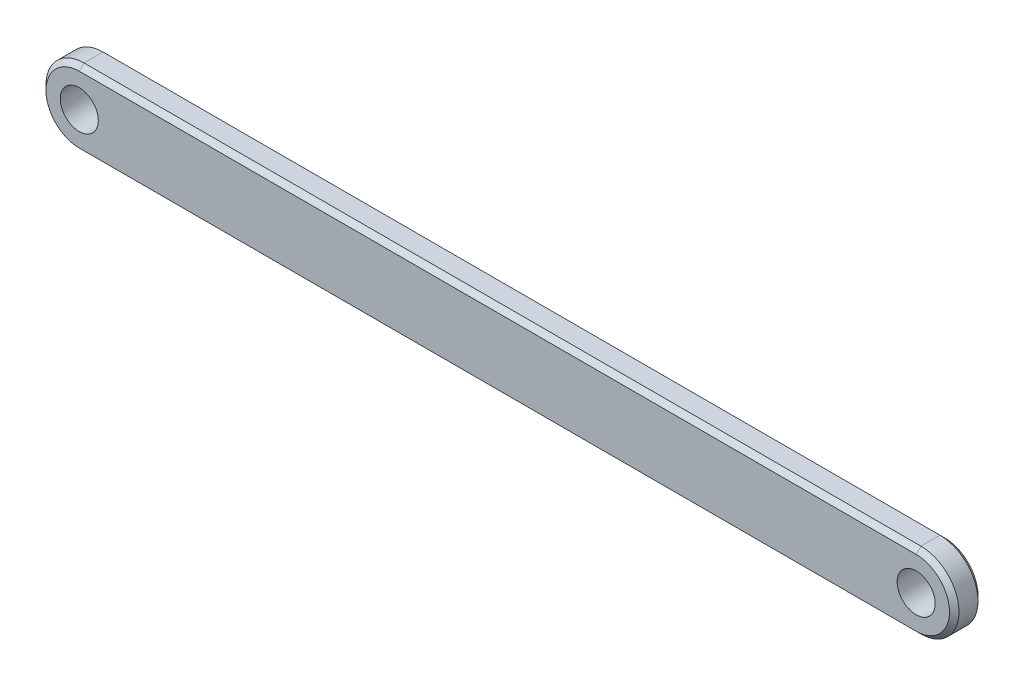
ISO-10303-21;
HEADER;
FILE_DESCRIPTION(('STEP AP214'),'2;1');
FILE_NAME('part.step','',(''),(''),'','','');
FILE_SCHEMA(('AUTOMOTIVE_DESIGN { 1 0 10303 214 1 1 1 1 }'));
ENDSEC;
DATA;
#1=APPLICATION_CONTEXT('core data for automotive mechanical design processes');
#2=APPLICATION_PROTOCOL_DEFINITION('international standard','automotive_design',2000,#1);
#3=PRODUCT_CONTEXT('',#1,'mechanical');
#4=PRODUCT('Part','Part','',(#3));
#5=PRODUCT_RELATED_PRODUCT_CATEGORY('part','',(#4));
#6=PRODUCT_DEFINITION_FORMATION('','',#4);
#7=PRODUCT_DEFINITION_CONTEXT('part definition',#1,'design');
#8=PRODUCT_DEFINITION('design','',#6,#7);
#9=PRODUCT_DEFINITION_SHAPE('','',#8);
#10=(LENGTH_UNIT() NAMED_UNIT(*) SI_UNIT(.MILLI.,.METRE.));
#11=(NAMED_UNIT(*) PLANE_ANGLE_UNIT() SI_UNIT($,.RADIAN.));
#12=(NAMED_UNIT(*) SI_UNIT($,.STERADIAN.) SOLID_ANGLE_UNIT());
#13=UNCERTAINTY_MEASURE_WITH_UNIT(LENGTH_MEASURE(1.E-05),#10,'distance_accuracy_value','');
#14=(GEOMETRIC_REPRESENTATION_CONTEXT(3) GLOBAL_UNCERTAINTY_ASSIGNED_CONTEXT((#13)) GLOBAL_UNIT_ASSIGNED_CONTEXT((#10,
#11,#12)) REPRESENTATION_CONTEXT('',''));
#15=CARTESIAN_POINT('',(0.,0.,0.));
#16=DIRECTION('',(0.,0.,1.));
#17=DIRECTION('',(1.,0.,0.));
#18=AXIS2_PLACEMENT_3D('',#15,#16,#17);
#19=CARTESIAN_POINT('',(-44.,0.,1.5));
#20=DIRECTION('',(0.,0.,1.));
#21=DIRECTION('',(1.,0.,0.));
#22=AXIS2_PLACEMENT_3D('',#19,#20,#21);
#23=PLANE('',#22);
#24=DIRECTION('',(1.,0.,0.));
#25=VECTOR('',#24,1.);
#26=CARTESIAN_POINT('',(44.,-3.49999999999998,1.5));
#27=LINE('',#26,#25);
#28=CARTESIAN_POINT('',(-44.,-3.5,1.5));
#29=VERTEX_POINT('',#28);
#30=CARTESIAN_POINT('',(44.,-3.49999999999998,1.5));
#31=VERTEX_POINT('',#30);
#32=EDGE_CURVE('E58',#29,#31,#27,.T.);
#33=ORIENTED_EDGE('',*,*,#32,.T.);
#34=CARTESIAN_POINT('',(44.,0.,1.5));
#35=DIRECTION('',(0.,0.,1.));
#36=DIRECTION('',(1.,0.,0.));
#37=AXIS2_PLACEMENT_3D('',#34,#35,#36);
#38=CIRCLE('',#37,3.5);
#39=CARTESIAN_POINT('',(44.,3.50000000000002,1.5));
#40=VERTEX_POINT('',#39);
#41=EDGE_CURVE('E11',#31,#40,#38,.T.);
#42=ORIENTED_EDGE('',*,*,#41,.T.);
#43=DIRECTION('',(-1.,0.,0.));
#44=VECTOR('',#43,1.);
#45=CARTESIAN_POINT('',(-44.,3.5,1.5));
#46=LINE('',#45,#44);
#47=CARTESIAN_POINT('',(-44.,3.5,1.5));
#48=VERTEX_POINT('',#47);
#49=EDGE_CURVE('E43',#40,#48,#46,.T.);
#50=ORIENTED_EDGE('',*,*,#49,.T.);
#51=CARTESIAN_POINT('',(-44.,0.,1.5));
#52=DIRECTION('',(0.,0.,1.));
#53=DIRECTION('',(1.,0.,0.));
#54=AXIS2_PLACEMENT_3D('',#51,#52,#53);
#55=CIRCLE('',#54,3.5);
#56=EDGE_CURVE('E198',#48,#29,#55,.T.);
#57=ORIENTED_EDGE('',*,*,#56,.T.);
#58=EDGE_LOOP('',(#33,#42,#50,#57));
#59=FACE_BOUND('',#58,.T.);
#60=CARTESIAN_POINT('',(-44.,0.,1.5));
#61=DIRECTION('',(0.,0.,1.));
#62=DIRECTION('',(1.,0.,0.));
#63=AXIS2_PLACEMENT_3D('',#60,#61,#62);
#64=CIRCLE('',#63,2.);
#65=CARTESIAN_POINT('',(-42.,0.,1.5));
#66=VERTEX_POINT('',#65);
#67=EDGE_CURVE('E171',#66,#66,#64,.T.);
#68=ORIENTED_EDGE('',*,*,#67,.F.);
#69=EDGE_LOOP('',(#68));
#70=FACE_BOUND('',#69,.T.);
#71=CARTESIAN_POINT('',(44.,0.,1.5));
#72=DIRECTION('',(0.,0.,1.));
#73=DIRECTION('',(1.,0.,0.));
#74=AXIS2_PLACEMENT_3D('',#71,#72,#73);
#75=CIRCLE('',#74,2.);
#76=CARTESIAN_POINT('',(46.,0.,1.5));
#77=VERTEX_POINT('',#76);
#78=EDGE_CURVE('E163',#77,#77,#75,.T.);
#79=ORIENTED_EDGE('',*,*,#78,.F.);
#80=EDGE_LOOP('',(#79));
#81=FACE_BOUND('',#80,.T.);
#82=ADVANCED_FACE('F34',(#59,#70,#81),#23,.T.);
#83=CARTESIAN_POINT('',(-44.,0.,-1.5));
#84=DIRECTION('',(0.,0.,1.));
#85=DIRECTION('',(1.,0.,0.));
#86=AXIS2_PLACEMENT_3D('',#83,#84,#85);
#87=PLANE('',#86);
#88=DIRECTION('',(1.,0.,0.));
#89=VECTOR('',#88,1.);
#90=CARTESIAN_POINT('',(-44.,3.5,-1.5));
#91=LINE('',#90,#89);
#92=CARTESIAN_POINT('',(-44.,3.5,-1.5));
#93=VERTEX_POINT('',#92);
#94=CARTESIAN_POINT('',(44.,3.50000000000002,-1.5));
#95=VERTEX_POINT('',#94);
#96=EDGE_CURVE('E185',#93,#95,#91,.T.);
#97=ORIENTED_EDGE('',*,*,#96,.T.);
#98=CARTESIAN_POINT('',(44.,0.,-1.5));
#99=DIRECTION('',(0.,0.,1.));
#100=DIRECTION('',(1.,0.,0.));
#101=AXIS2_PLACEMENT_3D('',#98,#99,#100);
#102=CIRCLE('',#101,3.5);
#103=CARTESIAN_POINT('',(44.,-3.49999999999998,-1.5));
#104=VERTEX_POINT('',#103);
#105=EDGE_CURVE('E114',#95,#104,#102,.F.);
#106=ORIENTED_EDGE('',*,*,#105,.T.);
#107=DIRECTION('',(-1.,0.,0.));
#108=VECTOR('',#107,1.);
#109=CARTESIAN_POINT('',(-44.,-3.5,-1.5));
#110=LINE('',#109,#108);
#111=CARTESIAN_POINT('',(-44.,-3.5,-1.5));
#112=VERTEX_POINT('',#111);
#113=EDGE_CURVE('E183',#104,#112,#110,.T.);
#114=ORIENTED_EDGE('',*,*,#113,.T.);
#115=CARTESIAN_POINT('',(-44.,0.,-1.5));
#116=DIRECTION('',(0.,0.,1.));
#117=DIRECTION('',(1.,0.,0.));
#118=AXIS2_PLACEMENT_3D('',#115,#116,#117);
#119=CIRCLE('',#118,3.5);
#120=EDGE_CURVE('E181',#112,#93,#119,.F.);
#121=ORIENTED_EDGE('',*,*,#120,.T.);
#122=EDGE_LOOP('',(#97,#106,#114,#121));
#123=FACE_BOUND('',#122,.T.);
#124=CARTESIAN_POINT('',(-44.,0.,-1.5));
#125=DIRECTION('',(0.,0.,1.));
#126=DIRECTION('',(1.,0.,0.));
#127=AXIS2_PLACEMENT_3D('',#124,#125,#126);
#128=CIRCLE('',#127,2.);
#129=CARTESIAN_POINT('',(-42.,0.,-1.5));
#130=VERTEX_POINT('',#129);
#131=EDGE_CURVE('E168',#130,#130,#128,.T.);
#132=ORIENTED_EDGE('',*,*,#131,.T.);
#133=EDGE_LOOP('',(#132));
#134=FACE_BOUND('',#133,.T.);
#135=CARTESIAN_POINT('',(44.,0.,-1.5));
#136=DIRECTION('',(0.,0.,1.));
#137=DIRECTION('',(1.,0.,0.));
#138=AXIS2_PLACEMENT_3D('',#135,#136,#137);
#139=CIRCLE('',#138,2.);
#140=CARTESIAN_POINT('',(46.,0.,-1.5));
#141=VERTEX_POINT('',#140);
#142=EDGE_CURVE('E157',#141,#141,#139,.T.);
#143=ORIENTED_EDGE('',*,*,#142,.T.);
#144=EDGE_LOOP('',(#143));
#145=FACE_BOUND('',#144,.T.);
#146=ADVANCED_FACE('F227',(#123,#134,#145),#87,.F.);
#147=CARTESIAN_POINT('',(-44.,0.,1.5));
#148=DIRECTION('',(0.,0.,-1.));
#149=DIRECTION('',(-1.,0.,0.));
#150=AXIS2_PLACEMENT_3D('',#147,#148,#149);
#151=CYLINDRICAL_SURFACE('',#150,4.);
#152=DIRECTION('',(0.,0.,-1.));
#153=VECTOR('',#152,1.);
#154=CARTESIAN_POINT('',(-44.,4.,1.5));
#155=LINE('',#154,#153);
#156=CARTESIAN_POINT('',(-44.,4.,1.));
#157=VERTEX_POINT('',#156);
#158=CARTESIAN_POINT('',(-44.,4.,-1.00000000000002));
#159=VERTEX_POINT('',#158);
#160=EDGE_CURVE('E109',#157,#159,#155,.T.);
#161=ORIENTED_EDGE('',*,*,#160,.T.);
#162=CARTESIAN_POINT('',(-44.,0.,-1.00000000000002));
#163=DIRECTION('',(0.,0.,1.));
#164=DIRECTION('',(1.,0.,0.));
#165=AXIS2_PLACEMENT_3D('',#162,#163,#164);
#166=CIRCLE('',#165,4.);
#167=CARTESIAN_POINT('',(-44.,-4.,-1.00000000000002));
#168=VERTEX_POINT('',#167);
#169=EDGE_CURVE('E196',#159,#168,#166,.T.);
#170=ORIENTED_EDGE('',*,*,#169,.T.);
#171=DIRECTION('',(0.,0.,-1.));
#172=VECTOR('',#171,1.);
#173=CARTESIAN_POINT('',(-44.,-4.,1.5));
#174=LINE('',#173,#172);
#175=CARTESIAN_POINT('',(-44.,-4.,1.));
#176=VERTEX_POINT('',#175);
#177=EDGE_CURVE('E130',#176,#168,#174,.T.);
#178=ORIENTED_EDGE('',*,*,#177,.F.);
#179=CARTESIAN_POINT('',(-44.,0.,1.));
#180=DIRECTION('',(0.,0.,1.));
#181=DIRECTION('',(1.,0.,0.));
#182=AXIS2_PLACEMENT_3D('',#179,#180,#181);
#183=CIRCLE('',#182,4.);
#184=EDGE_CURVE('E194',#176,#157,#183,.F.);
#185=ORIENTED_EDGE('',*,*,#184,.T.);
#186=EDGE_LOOP('',(#161,#170,#178,#185));
#187=FACE_BOUND('',#186,.T.);
#188=ADVANCED_FACE('F209',(#187),#151,.T.);
#189=CARTESIAN_POINT('',(-44.,-4.,1.5));
#190=DIRECTION('',(0.,1.,0.));
#191=DIRECTION('',(-1.,0.,0.));
#192=AXIS2_PLACEMENT_3D('',#189,#190,#191);
#193=PLANE('',#192);
#194=ORIENTED_EDGE('',*,*,#177,.T.);
#195=DIRECTION('',(1.,0.,0.));
#196=VECTOR('',#195,1.);
#197=CARTESIAN_POINT('',(-44.,-4.,-1.00000000000002));
#198=LINE('',#197,#196);
#199=CARTESIAN_POINT('',(44.,-3.99999999999998,-1.00000000000002));
#200=VERTEX_POINT('',#199);
#201=EDGE_CURVE('E192',#168,#200,#198,.T.);
#202=ORIENTED_EDGE('',*,*,#201,.T.);
#203=DIRECTION('',(0.,0.,-1.));
#204=VECTOR('',#203,1.);
#205=CARTESIAN_POINT('',(44.,-3.99999999999998,1.5));
#206=LINE('',#205,#204);
#207=CARTESIAN_POINT('',(44.,-3.99999999999998,1.));
#208=VERTEX_POINT('',#207);
#209=EDGE_CURVE('E125',#208,#200,#206,.T.);
#210=ORIENTED_EDGE('',*,*,#209,.F.);
#211=DIRECTION('',(-1.,0.,0.));
#212=VECTOR('',#211,1.);
#213=CARTESIAN_POINT('',(-44.,-4.,1.));
#214=LINE('',#213,#212);
#215=EDGE_CURVE('E190',#208,#176,#214,.T.);
#216=ORIENTED_EDGE('',*,*,#215,.T.);
#217=EDGE_LOOP('',(#194,#202,#210,#216));
#218=FACE_BOUND('',#217,.T.);
#219=ADVANCED_FACE('F207',(#218),#193,.F.);
#220=CARTESIAN_POINT('',(44.,0.,1.5));
#221=DIRECTION('',(0.,0.,-1.));
#222=DIRECTION('',(-1.,0.,0.));
#223=AXIS2_PLACEMENT_3D('',#220,#221,#222);
#224=CYLINDRICAL_SURFACE('',#223,4.);
#225=ORIENTED_EDGE('',*,*,#209,.T.);
#226=CARTESIAN_POINT('',(44.,0.,-1.00000000000002));
#227=DIRECTION('',(0.,0.,1.));
#228=DIRECTION('',(1.,0.,0.));
#229=AXIS2_PLACEMENT_3D('',#226,#227,#228);
#230=CIRCLE('',#229,4.);
#231=CARTESIAN_POINT('',(44.,4.00000000000002,-1.00000000000002));
#232=VERTEX_POINT('',#231);
#233=EDGE_CURVE('E124',#200,#232,#230,.T.);
#234=ORIENTED_EDGE('',*,*,#233,.T.);
#235=DIRECTION('',(0.,0.,-1.));
#236=VECTOR('',#235,1.);
#237=CARTESIAN_POINT('',(44.,4.00000000000002,1.5));
#238=LINE('',#237,#236);
#239=CARTESIAN_POINT('',(44.,4.00000000000002,1.));
#240=VERTEX_POINT('',#239);
#241=EDGE_CURVE('E107',#240,#232,#238,.T.);
#242=ORIENTED_EDGE('',*,*,#241,.F.);
#243=CARTESIAN_POINT('',(44.,0.,1.));
#244=DIRECTION('',(0.,0.,1.));
#245=DIRECTION('',(1.,0.,0.));
#246=AXIS2_PLACEMENT_3D('',#243,#244,#245);
#247=CIRCLE('',#246,4.);
#248=EDGE_CURVE('E121',#240,#208,#247,.F.);
#249=ORIENTED_EDGE('',*,*,#248,.T.);
#250=EDGE_LOOP('',(#225,#234,#242,#249));
#251=FACE_BOUND('',#250,.T.);
#252=ADVANCED_FACE('F120',(#251),#224,.T.);
#253=CARTESIAN_POINT('',(-44.,4.,1.5));
#254=DIRECTION('',(0.,-1.,0.));
#255=DIRECTION('',(1.,0.,0.));
#256=AXIS2_PLACEMENT_3D('',#253,#254,#255);
#257=PLANE('',#256);
#258=ORIENTED_EDGE('',*,*,#241,.T.);
#259=DIRECTION('',(-1.,0.,0.));
#260=VECTOR('',#259,1.);
#261=CARTESIAN_POINT('',(-44.,4.,-1.00000000000002));
#262=LINE('',#261,#260);
#263=EDGE_CURVE('E113',#232,#159,#262,.T.);
#264=ORIENTED_EDGE('',*,*,#263,.T.);
#265=ORIENTED_EDGE('',*,*,#160,.F.);
#266=DIRECTION('',(1.,0.,0.));
#267=VECTOR('',#266,1.);
#268=CARTESIAN_POINT('',(44.,4.00000000000002,1.));
#269=LINE('',#268,#267);
#270=EDGE_CURVE('E104',#157,#240,#269,.T.);
#271=ORIENTED_EDGE('',*,*,#270,.T.);
#272=EDGE_LOOP('',(#258,#264,#265,#271));
#273=FACE_BOUND('',#272,.T.);
#274=ADVANCED_FACE('F106',(#273),#257,.F.);
#275=CARTESIAN_POINT('',(-44.,0.,1.5));
#276=DIRECTION('',(0.,0.,-1.));
#277=DIRECTION('',(-1.,0.,0.));
#278=AXIS2_PLACEMENT_3D('',#275,#276,#277);
#279=CYLINDRICAL_SURFACE('',#278,2.);
#280=ORIENTED_EDGE('',*,*,#67,.T.);
#281=EDGE_LOOP('',(#280));
#282=FACE_BOUND('',#281,.T.);
#283=ORIENTED_EDGE('',*,*,#131,.F.);
#284=EDGE_LOOP('',(#283));
#285=FACE_BOUND('',#284,.T.);
#286=ADVANCED_FACE('F235',(#282,#285),#279,.F.);
#287=CARTESIAN_POINT('',(44.,0.,1.5));
#288=DIRECTION('',(0.,0.,-1.));
#289=DIRECTION('',(-1.,0.,0.));
#290=AXIS2_PLACEMENT_3D('',#287,#288,#289);
#291=CYLINDRICAL_SURFACE('',#290,2.);
#292=ORIENTED_EDGE('',*,*,#78,.T.);
#293=EDGE_LOOP('',(#292));
#294=FACE_BOUND('',#293,.T.);
#295=ORIENTED_EDGE('',*,*,#142,.F.);
#296=EDGE_LOOP('',(#295));
#297=FACE_BOUND('',#296,.T.);
#298=ADVANCED_FACE('F267',(#294,#297),#291,.F.);
#299=CARTESIAN_POINT('',(-44.,0.,-1.00000000000002));
#300=DIRECTION('',(0.,0.,1.));
#301=DIRECTION('',(1.,0.,0.));
#302=AXIS2_PLACEMENT_3D('',#299,#300,#301);
#303=CONICAL_SURFACE('',#302,4.,0.785398163397466);
#304=DIRECTION('',(0.,0.70710678118656,0.707106781186535));
#305=VECTOR('',#304,1.);
#306=CARTESIAN_POINT('',(-44.,3.5,-1.5));
#307=LINE('',#306,#305);
#308=EDGE_CURVE('E149',#93,#159,#307,.T.);
#309=ORIENTED_EDGE('',*,*,#308,.F.);
#310=ORIENTED_EDGE('',*,*,#120,.F.);
#311=DIRECTION('',(0.,0.70710678118656,-0.707106781186535));
#312=VECTOR('',#311,1.);
#313=CARTESIAN_POINT('',(-44.,-4.,-1.00000000000002));
#314=LINE('',#313,#312);
#315=EDGE_CURVE('E137',#168,#112,#314,.T.);
#316=ORIENTED_EDGE('',*,*,#315,.F.);
#317=ORIENTED_EDGE('',*,*,#169,.F.);
#318=EDGE_LOOP('',(#309,#310,#316,#317));
#319=FACE_BOUND('',#318,.T.);
#320=ADVANCED_FACE('F212',(#319),#303,.T.);
#321=CARTESIAN_POINT('',(-44.,-4.,-1.00000000000002));
#322=DIRECTION('',(0.,0.707106781186535,0.70710678118656));
#323=DIRECTION('',(1.,0.,0.));
#324=AXIS2_PLACEMENT_3D('',#321,#322,#323);
#325=PLANE('',#324);
#326=ORIENTED_EDGE('',*,*,#315,.T.);
#327=ORIENTED_EDGE('',*,*,#113,.F.);
#328=DIRECTION('',(0.,0.70710678118656,-0.707106781186535));
#329=VECTOR('',#328,1.);
#330=CARTESIAN_POINT('',(44.,-3.99999999999998,-1.00000000000002));
#331=LINE('',#330,#329);
#332=EDGE_CURVE('E143',#200,#104,#331,.T.);
#333=ORIENTED_EDGE('',*,*,#332,.F.);
#334=ORIENTED_EDGE('',*,*,#201,.F.);
#335=EDGE_LOOP('',(#326,#327,#333,#334));
#336=FACE_BOUND('',#335,.T.);
#337=ADVANCED_FACE('F215',(#336),#325,.F.);
#338=CARTESIAN_POINT('',(-44.,4.,-1.00000000000002));
#339=DIRECTION('',(0.,-0.707106781186535,0.70710678118656));
#340=DIRECTION('',(-1.,0.,0.));
#341=AXIS2_PLACEMENT_3D('',#338,#339,#340);
#342=PLANE('',#341);
#343=ORIENTED_EDGE('',*,*,#308,.T.);
#344=ORIENTED_EDGE('',*,*,#263,.F.);
#345=DIRECTION('',(0.,0.70710678118656,0.707106781186535));
#346=VECTOR('',#345,1.);
#347=CARTESIAN_POINT('',(44.,3.50000000000002,-1.5));
#348=LINE('',#347,#346);
#349=EDGE_CURVE('E140',#95,#232,#348,.T.);
#350=ORIENTED_EDGE('',*,*,#349,.F.);
#351=ORIENTED_EDGE('',*,*,#96,.F.);
#352=EDGE_LOOP('',(#343,#344,#350,#351));
#353=FACE_BOUND('',#352,.T.);
#354=ADVANCED_FACE('F218',(#353),#342,.F.);
#355=CARTESIAN_POINT('',(44.,0.,-1.00000000000002));
#356=DIRECTION('',(0.,0.,1.));
#357=DIRECTION('',(1.,0.,0.));
#358=AXIS2_PLACEMENT_3D('',#355,#356,#357);
#359=CONICAL_SURFACE('',#358,4.,0.785398163397466);
#360=ORIENTED_EDGE('',*,*,#332,.T.);
#361=ORIENTED_EDGE('',*,*,#105,.F.);
#362=ORIENTED_EDGE('',*,*,#349,.T.);
#363=ORIENTED_EDGE('',*,*,#233,.F.);
#364=EDGE_LOOP('',(#360,#361,#362,#363));
#365=FACE_BOUND('',#364,.T.);
#366=ADVANCED_FACE('F216',(#365),#359,.T.);
#367=CARTESIAN_POINT('',(-44.,0.,1.5));
#368=DIRECTION('',(0.,0.,-1.));
#369=DIRECTION('',(-1.,0.,0.));
#370=AXIS2_PLACEMENT_3D('',#367,#368,#369);
#371=CONICAL_SURFACE('',#370,3.5,0.785398163397452);
#372=DIRECTION('',(0.,-0.70710678118655,0.707106781186545));
#373=VECTOR('',#372,1.);
#374=CARTESIAN_POINT('',(-44.,4.,1.));
#375=LINE('',#374,#373);
#376=EDGE_CURVE('E134',#157,#48,#375,.T.);
#377=ORIENTED_EDGE('',*,*,#376,.F.);
#378=ORIENTED_EDGE('',*,*,#184,.F.);
#379=DIRECTION('',(0.,-0.70710678118655,-0.707106781186545));
#380=VECTOR('',#379,1.);
#381=CARTESIAN_POINT('',(-44.,-3.5,1.5));
#382=LINE('',#381,#380);
#383=EDGE_CURVE('E38',#29,#176,#382,.T.);
#384=ORIENTED_EDGE('',*,*,#383,.F.);
#385=ORIENTED_EDGE('',*,*,#56,.F.);
#386=EDGE_LOOP('',(#377,#378,#384,#385));
#387=FACE_BOUND('',#386,.T.);
#388=ADVANCED_FACE('F36',(#387),#371,.T.);
#389=CARTESIAN_POINT('',(-44.,-3.5,1.5));
#390=DIRECTION('',(0.,-0.707106781186545,0.70710678118655));
#391=DIRECTION('',(-1.,0.,0.));
#392=AXIS2_PLACEMENT_3D('',#389,#390,#391);
#393=PLANE('',#392);
#394=ORIENTED_EDGE('',*,*,#383,.T.);
#395=ORIENTED_EDGE('',*,*,#215,.F.);
#396=DIRECTION('',(0.,-0.70710678118655,-0.707106781186545));
#397=VECTOR('',#396,1.);
#398=CARTESIAN_POINT('',(44.,-3.49999999999998,1.5));
#399=LINE('',#398,#397);
#400=EDGE_CURVE('E128',#31,#208,#399,.T.);
#401=ORIENTED_EDGE('',*,*,#400,.F.);
#402=ORIENTED_EDGE('',*,*,#32,.F.);
#403=EDGE_LOOP('',(#394,#395,#401,#402));
#404=FACE_BOUND('',#403,.T.);
#405=ADVANCED_FACE('F204',(#404),#393,.T.);
#406=CARTESIAN_POINT('',(-44.,3.5,1.5));
#407=DIRECTION('',(0.,0.707106781186545,0.70710678118655));
#408=DIRECTION('',(1.,0.,0.));
#409=AXIS2_PLACEMENT_3D('',#406,#407,#408);
#410=PLANE('',#409);
#411=ORIENTED_EDGE('',*,*,#376,.T.);
#412=ORIENTED_EDGE('',*,*,#49,.F.);
#413=DIRECTION('',(0.,-0.70710678118655,0.707106781186545));
#414=VECTOR('',#413,1.);
#415=CARTESIAN_POINT('',(44.,4.00000000000002,1.));
#416=LINE('',#415,#414);
#417=EDGE_CURVE('E51',#240,#40,#416,.T.);
#418=ORIENTED_EDGE('',*,*,#417,.F.);
#419=ORIENTED_EDGE('',*,*,#270,.F.);
#420=EDGE_LOOP('',(#411,#412,#418,#419));
#421=FACE_BOUND('',#420,.T.);
#422=ADVANCED_FACE('F132',(#421),#410,.T.);
#423=CARTESIAN_POINT('',(44.,0.,1.5));
#424=DIRECTION('',(0.,0.,-1.));
#425=DIRECTION('',(-1.,0.,0.));
#426=AXIS2_PLACEMENT_3D('',#423,#424,#425);
#427=CONICAL_SURFACE('',#426,3.5,0.785398163397452);
#428=ORIENTED_EDGE('',*,*,#400,.T.);
#429=ORIENTED_EDGE('',*,*,#248,.F.);
#430=ORIENTED_EDGE('',*,*,#417,.T.);
#431=ORIENTED_EDGE('',*,*,#41,.F.);
#432=EDGE_LOOP('',(#428,#429,#430,#431));
#433=FACE_BOUND('',#432,.T.);
#434=ADVANCED_FACE('F127',(#433),#427,.T.);
#435=CLOSED_SHELL('',(#82,#146,#188,#219,#252,#274,#286,#298,#320,#337,#354,#366,#388,#405,#422,#434));
#436=MANIFOLD_SOLID_BREP('B2',#435);
#437=ADVANCED_BREP_SHAPE_REPRESENTATION('',(#18,#436),#14);
#438=SHAPE_DEFINITION_REPRESENTATION(#9,#437);
ENDSEC;
END-ISO-10303-21;
